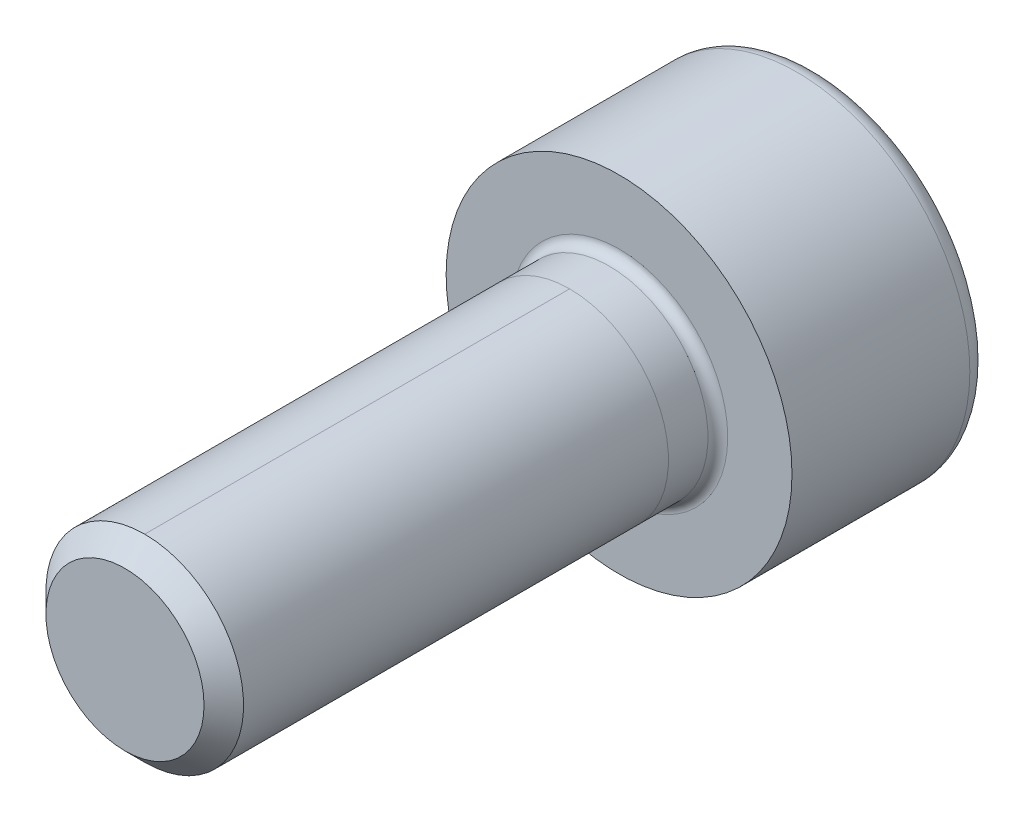
ISO-10303-21;
HEADER;
FILE_DESCRIPTION(('STEP AP214'),'2;1');
FILE_NAME('part.step','',(''),(''),'','','');
FILE_SCHEMA(('AUTOMOTIVE_DESIGN { 1 0 10303 214 1 1 1 1 }'));
ENDSEC;
DATA;
#1=APPLICATION_CONTEXT('core data for automotive mechanical design processes');
#2=APPLICATION_PROTOCOL_DEFINITION('international standard','automotive_design',2000,#1);
#3=PRODUCT_CONTEXT('',#1,'mechanical');
#4=PRODUCT('Part','Part','',(#3));
#5=PRODUCT_RELATED_PRODUCT_CATEGORY('part','',(#4));
#6=PRODUCT_DEFINITION_FORMATION('','',#4);
#7=PRODUCT_DEFINITION_CONTEXT('part definition',#1,'design');
#8=PRODUCT_DEFINITION('design','',#6,#7);
#9=PRODUCT_DEFINITION_SHAPE('','',#8);
#10=(LENGTH_UNIT() NAMED_UNIT(*) SI_UNIT(.MILLI.,.METRE.));
#11=(NAMED_UNIT(*) PLANE_ANGLE_UNIT() SI_UNIT($,.RADIAN.));
#12=(NAMED_UNIT(*) SI_UNIT($,.STERADIAN.) SOLID_ANGLE_UNIT());
#13=UNCERTAINTY_MEASURE_WITH_UNIT(LENGTH_MEASURE(1.E-05),#10,'distance_accuracy_value','');
#14=(GEOMETRIC_REPRESENTATION_CONTEXT(3) GLOBAL_UNCERTAINTY_ASSIGNED_CONTEXT((#13)) GLOBAL_UNIT_ASSIGNED_CONTEXT((#10,
#11,#12)) REPRESENTATION_CONTEXT('',''));
#15=CARTESIAN_POINT('',(0.,0.,0.));
#16=DIRECTION('',(0.,0.,1.));
#17=DIRECTION('',(1.,0.,0.));
#18=AXIS2_PLACEMENT_3D('',#15,#16,#17);
#19=CARTESIAN_POINT('',(0.,0.,10.));
#20=DIRECTION('',(0.,0.,-1.));
#21=DIRECTION('',(-1.,0.,0.));
#22=AXIS2_PLACEMENT_3D('',#19,#20,#21);
#23=CYLINDRICAL_SURFACE('',#22,2.);
#24=DIRECTION('',(0.,0.,-1.));
#25=VECTOR('',#24,1.);
#26=CARTESIAN_POINT('',(0.,2.,10.));
#27=LINE('',#26,#25);
#28=CARTESIAN_POINT('',(0.,2.,9.6));
#29=VERTEX_POINT('',#28);
#30=CARTESIAN_POINT('',(0.,2.,1.));
#31=VERTEX_POINT('',#30);
#32=EDGE_CURVE('E60',#29,#31,#27,.T.);
#33=ORIENTED_EDGE('',*,*,#32,.F.);
#34=CARTESIAN_POINT('',(0.,0.,9.6));
#35=DIRECTION('',(0.,0.,1.));
#36=DIRECTION('',(1.,0.,0.));
#37=AXIS2_PLACEMENT_3D('',#34,#35,#36);
#38=CIRCLE('',#37,2.);
#39=CARTESIAN_POINT('',(0.,-2.,9.6));
#40=VERTEX_POINT('',#39);
#41=EDGE_CURVE('E194',#29,#40,#38,.F.);
#42=ORIENTED_EDGE('',*,*,#41,.T.);
#43=DIRECTION('',(0.,0.,-1.));
#44=VECTOR('',#43,1.);
#45=CARTESIAN_POINT('',(0.,-2.,10.));
#46=LINE('',#45,#44);
#47=CARTESIAN_POINT('',(0.,-2.,0.999999999999999));
#48=VERTEX_POINT('',#47);
#49=EDGE_CURVE('E197',#40,#48,#46,.T.);
#50=ORIENTED_EDGE('',*,*,#49,.T.);
#51=CARTESIAN_POINT('',(0.,0.,0.999999999999999));
#52=DIRECTION('',(0.,0.,1.));
#53=DIRECTION('',(0.,-1.,0.));
#54=AXIS2_PLACEMENT_3D('',#51,#52,#53);
#55=CIRCLE('',#54,2.);
#56=EDGE_CURVE('E66',#48,#31,#55,.T.);
#57=ORIENTED_EDGE('',*,*,#56,.T.);
#58=EDGE_LOOP('',(#33,#42,#50,#57));
#59=FACE_BOUND('',#58,.T.);
#60=ADVANCED_FACE('F45',(#59),#23,.T.);
#61=CARTESIAN_POINT('',(0.,0.,0.200000000000001));
#62=DIRECTION('',(0.,0.,-1.));
#63=DIRECTION('',(-1.,0.,0.));
#64=AXIS2_PLACEMENT_3D('',#61,#62,#63);
#65=CIRCLE('',#64,2.);
#66=CARTESIAN_POINT('',(-2.,0.,0.200000000000001));
#67=VERTEX_POINT('',#66);
#68=EDGE_CURVE('E12',#67,#67,#65,.F.);
#69=ORIENTED_EDGE('',*,*,#68,.T.);
#70=EDGE_LOOP('',(#69));
#71=FACE_BOUND('',#70,.T.);
#72=ORIENTED_EDGE('',*,*,#56,.F.);
#73=EDGE_CURVE('E219',#31,#48,#55,.T.);
#74=ORIENTED_EDGE('',*,*,#73,.F.);
#75=EDGE_LOOP('',(#72,#74));
#76=FACE_BOUND('',#75,.T.);
#77=ADVANCED_FACE('F237',(#71,#76),#23,.T.);
#78=EDGE_CURVE('E195',#40,#29,#38,.F.);
#79=ORIENTED_EDGE('',*,*,#78,.T.);
#80=ORIENTED_EDGE('',*,*,#32,.T.);
#81=ORIENTED_EDGE('',*,*,#73,.T.);
#82=ORIENTED_EDGE('',*,*,#49,.F.);
#83=EDGE_LOOP('',(#79,#80,#81,#82));
#84=FACE_BOUND('',#83,.T.);
#85=ADVANCED_FACE('F240',(#84),#23,.T.);
#86=CARTESIAN_POINT('',(0.,0.,10.));
#87=DIRECTION('',(0.,0.,1.));
#88=DIRECTION('',(1.,0.,0.));
#89=AXIS2_PLACEMENT_3D('',#86,#87,#88);
#90=PLANE('',#89);
#91=CARTESIAN_POINT('',(0.,0.,10.));
#92=DIRECTION('',(0.,0.,1.));
#93=DIRECTION('',(1.,0.,0.));
#94=AXIS2_PLACEMENT_3D('',#91,#92,#93);
#95=CIRCLE('',#94,1.6);
#96=CARTESIAN_POINT('',(1.6,0.,10.));
#97=VERTEX_POINT('',#96);
#98=EDGE_CURVE('E191',#97,#97,#95,.T.);
#99=ORIENTED_EDGE('',*,*,#98,.T.);
#100=EDGE_LOOP('',(#99));
#101=FACE_BOUND('',#100,.T.);
#102=ADVANCED_FACE('F248',(#101),#90,.T.);
#103=CARTESIAN_POINT('',(0.,0.,0.));
#104=DIRECTION('',(0.,0.,-1.));
#105=DIRECTION('',(-1.,0.,0.));
#106=AXIS2_PLACEMENT_3D('',#103,#104,#105);
#107=PLANE('',#106);
#108=CARTESIAN_POINT('',(0.,0.,0.));
#109=DIRECTION('',(0.,0.,-1.));
#110=DIRECTION('',(-1.,0.,0.));
#111=AXIS2_PLACEMENT_3D('',#108,#109,#110);
#112=CIRCLE('',#111,2.2);
#113=CARTESIAN_POINT('',(-2.2,0.,0.));
#114=VERTEX_POINT('',#113);
#115=EDGE_CURVE('E53',#114,#114,#112,.T.);
#116=ORIENTED_EDGE('',*,*,#115,.T.);
#117=EDGE_LOOP('',(#116));
#118=FACE_BOUND('',#117,.T.);
#119=CARTESIAN_POINT('',(0.,0.,0.));
#120=DIRECTION('',(0.,0.,-1.));
#121=DIRECTION('',(-1.,0.,0.));
#122=AXIS2_PLACEMENT_3D('',#119,#120,#121);
#123=CIRCLE('',#122,3.5);
#124=CARTESIAN_POINT('',(-3.5,0.,0.));
#125=VERTEX_POINT('',#124);
#126=EDGE_CURVE('E181',#125,#125,#123,.T.);
#127=ORIENTED_EDGE('',*,*,#126,.F.);
#128=EDGE_LOOP('',(#127));
#129=FACE_BOUND('',#128,.T.);
#130=ADVANCED_FACE('F226',(#118,#129),#107,.F.);
#131=CARTESIAN_POINT('',(0.,0.,-4.));
#132=DIRECTION('',(0.,0.,1.));
#133=DIRECTION('',(1.,0.,0.));
#134=AXIS2_PLACEMENT_3D('',#131,#132,#133);
#135=CYLINDRICAL_SURFACE('',#134,3.5);
#136=CARTESIAN_POINT('',(0.,0.,-3.6));
#137=DIRECTION('',(0.,0.,-1.));
#138=DIRECTION('',(-1.,0.,0.));
#139=AXIS2_PLACEMENT_3D('',#136,#137,#138);
#140=CIRCLE('',#139,3.5);
#141=CARTESIAN_POINT('',(-3.5,0.,-3.6));
#142=VERTEX_POINT('',#141);
#143=EDGE_CURVE('E188',#142,#142,#140,.F.);
#144=ORIENTED_EDGE('',*,*,#143,.T.);
#145=EDGE_LOOP('',(#144));
#146=FACE_BOUND('',#145,.T.);
#147=ORIENTED_EDGE('',*,*,#126,.T.);
#148=EDGE_LOOP('',(#147));
#149=FACE_BOUND('',#148,.T.);
#150=ADVANCED_FACE('F284',(#146,#149),#135,.T.);
#151=CARTESIAN_POINT('',(0.,0.,-4.));
#152=DIRECTION('',(0.,0.,-1.));
#153=DIRECTION('',(-1.,0.,0.));
#154=AXIS2_PLACEMENT_3D('',#151,#152,#153);
#155=PLANE('',#154);
#156=DIRECTION('',(0.5,-0.866025403784439,0.));
#157=VECTOR('',#156,1.);
#158=CARTESIAN_POINT('',(0.721687836487032,1.25,-4.));
#159=LINE('',#158,#157);
#160=CARTESIAN_POINT('',(0.721687836487032,1.25,-4.));
#161=VERTEX_POINT('',#160);
#162=CARTESIAN_POINT('',(1.44337567297406,0.,-4.));
#163=VERTEX_POINT('',#162);
#164=EDGE_CURVE('E124',#161,#163,#159,.T.);
#165=ORIENTED_EDGE('',*,*,#164,.F.);
#166=DIRECTION('',(1.,0.,0.));
#167=VECTOR('',#166,1.);
#168=CARTESIAN_POINT('',(-0.721687836487033,1.25,-4.));
#169=LINE('',#168,#167);
#170=CARTESIAN_POINT('',(-0.721687836487033,1.25,-4.));
#171=VERTEX_POINT('',#170);
#172=EDGE_CURVE('E178',#171,#161,#169,.T.);
#173=ORIENTED_EDGE('',*,*,#172,.F.);
#174=DIRECTION('',(0.5,0.866025403784439,0.));
#175=VECTOR('',#174,1.);
#176=CARTESIAN_POINT('',(-1.44337567297406,0.,-4.));
#177=LINE('',#176,#175);
#178=CARTESIAN_POINT('',(-1.44337567297406,0.,-4.));
#179=VERTEX_POINT('',#178);
#180=EDGE_CURVE('E175',#179,#171,#177,.T.);
#181=ORIENTED_EDGE('',*,*,#180,.F.);
#182=DIRECTION('',(-0.5,0.866025403784439,0.));
#183=VECTOR('',#182,1.);
#184=CARTESIAN_POINT('',(-0.721687836487033,-1.25,-4.));
#185=LINE('',#184,#183);
#186=CARTESIAN_POINT('',(-0.721687836487033,-1.25,-4.));
#187=VERTEX_POINT('',#186);
#188=EDGE_CURVE('E172',#187,#179,#185,.T.);
#189=ORIENTED_EDGE('',*,*,#188,.F.);
#190=DIRECTION('',(-1.,0.,0.));
#191=VECTOR('',#190,1.);
#192=CARTESIAN_POINT('',(0.721687836487032,-1.25,-4.));
#193=LINE('',#192,#191);
#194=CARTESIAN_POINT('',(0.721687836487032,-1.25,-4.));
#195=VERTEX_POINT('',#194);
#196=EDGE_CURVE('E169',#195,#187,#193,.T.);
#197=ORIENTED_EDGE('',*,*,#196,.F.);
#198=DIRECTION('',(-0.5,-0.866025403784439,0.));
#199=VECTOR('',#198,1.);
#200=CARTESIAN_POINT('',(1.44337567297406,0.,-4.));
#201=LINE('',#200,#199);
#202=EDGE_CURVE('E166',#163,#195,#201,.T.);
#203=ORIENTED_EDGE('',*,*,#202,.F.);
#204=EDGE_LOOP('',(#165,#173,#181,#189,#197,#203));
#205=FACE_BOUND('',#204,.T.);
#206=CARTESIAN_POINT('',(0.,0.,-4.));
#207=DIRECTION('',(0.,0.,-1.));
#208=DIRECTION('',(-1.,0.,0.));
#209=AXIS2_PLACEMENT_3D('',#206,#207,#208);
#210=CIRCLE('',#209,3.1);
#211=CARTESIAN_POINT('',(-3.1,0.,-4.));
#212=VERTEX_POINT('',#211);
#213=EDGE_CURVE('E184',#212,#212,#210,.T.);
#214=ORIENTED_EDGE('',*,*,#213,.T.);
#215=EDGE_LOOP('',(#214));
#216=FACE_BOUND('',#215,.T.);
#217=ADVANCED_FACE('F279',(#205,#216),#155,.T.);
#218=CARTESIAN_POINT('',(0.,0.,-3.6));
#219=DIRECTION('',(0.,0.,-1.));
#220=DIRECTION('',(-1.,0.,0.));
#221=AXIS2_PLACEMENT_3D('',#218,#219,#220);
#222=TOROIDAL_SURFACE('',#221,3.1,0.4);
#223=ORIENTED_EDGE('',*,*,#143,.F.);
#224=EDGE_LOOP('',(#223));
#225=FACE_BOUND('',#224,.T.);
#226=ORIENTED_EDGE('',*,*,#213,.F.);
#227=EDGE_LOOP('',(#226));
#228=FACE_BOUND('',#227,.T.);
#229=ADVANCED_FACE('F270',(#225,#228),#222,.T.);
#230=CARTESIAN_POINT('',(0.,0.,10.));
#231=DIRECTION('',(0.,0.,-1.));
#232=DIRECTION('',(-1.,0.,0.));
#233=AXIS2_PLACEMENT_3D('',#230,#231,#232);
#234=CONICAL_SURFACE('',#233,1.6,0.785398163397446);
#235=ORIENTED_EDGE('',*,*,#78,.F.);
#236=ORIENTED_EDGE('',*,*,#41,.F.);
#237=EDGE_LOOP('',(#235,#236));
#238=FACE_BOUND('',#237,.T.);
#239=ORIENTED_EDGE('',*,*,#98,.F.);
#240=EDGE_LOOP('',(#239));
#241=FACE_BOUND('',#240,.T.);
#242=ADVANCED_FACE('F257',(#238,#241),#234,.T.);
#243=CARTESIAN_POINT('',(0.721687836487032,1.25,-2.88888888888889));
#244=DIRECTION('',(0.866025403784439,0.5,0.));
#245=DIRECTION('',(-0.5,0.866025403784439,0.));
#246=AXIS2_PLACEMENT_3D('',#243,#244,#245);
#247=PLANE('',#246);
#248=ORIENTED_EDGE('',*,*,#164,.T.);
#249=DIRECTION('',(0.,0.,-1.));
#250=VECTOR('',#249,1.);
#251=CARTESIAN_POINT('',(1.44337567297406,0.,-2.88888888888889));
#252=LINE('',#251,#250);
#253=CARTESIAN_POINT('',(1.44337567297406,0.,-2.88888888888889));
#254=VERTEX_POINT('',#253);
#255=EDGE_CURVE('E202',#254,#163,#252,.T.);
#256=ORIENTED_EDGE('',*,*,#255,.F.);
#257=DIRECTION('',(-0.5,0.866025403784439,0.));
#258=VECTOR('',#257,1.);
#259=CARTESIAN_POINT('',(1.44337567297407,0.,-2.88888888888889));
#260=LINE('',#259,#258);
#261=CARTESIAN_POINT('',(0.721687836487032,1.25,-2.88888888888889));
#262=VERTEX_POINT('',#261);
#263=EDGE_CURVE('E119',#262,#254,#260,.F.);
#264=ORIENTED_EDGE('',*,*,#263,.F.);
#265=DIRECTION('',(0.,0.,-1.));
#266=VECTOR('',#265,1.);
#267=CARTESIAN_POINT('',(0.721687836487032,1.25,-2.88888888888889));
#268=LINE('',#267,#266);
#269=EDGE_CURVE('E185',#262,#161,#268,.T.);
#270=ORIENTED_EDGE('',*,*,#269,.T.);
#271=EDGE_LOOP('',(#248,#256,#264,#270));
#272=FACE_BOUND('',#271,.T.);
#273=ADVANCED_FACE('F269',(#272),#247,.F.);
#274=CARTESIAN_POINT('',(-0.721687836487033,1.25,-2.88888888888889));
#275=DIRECTION('',(0.,1.,0.));
#276=DIRECTION('',(-1.,0.,0.));
#277=AXIS2_PLACEMENT_3D('',#274,#275,#276);
#278=PLANE('',#277);
#279=ORIENTED_EDGE('',*,*,#172,.T.);
#280=ORIENTED_EDGE('',*,*,#269,.F.);
#281=DIRECTION('',(1.,0.,0.));
#282=VECTOR('',#281,1.);
#283=CARTESIAN_POINT('',(0.,1.25,-2.88888888888889));
#284=LINE('',#283,#282);
#285=CARTESIAN_POINT('',(-0.721687836487033,1.25,-2.88888888888889));
#286=VERTEX_POINT('',#285);
#287=EDGE_CURVE('E133',#286,#262,#284,.T.);
#288=ORIENTED_EDGE('',*,*,#287,.F.);
#289=DIRECTION('',(0.,0.,-1.));
#290=VECTOR('',#289,1.);
#291=CARTESIAN_POINT('',(-0.721687836487033,1.25,-2.88888888888889));
#292=LINE('',#291,#290);
#293=EDGE_CURVE('E198',#286,#171,#292,.T.);
#294=ORIENTED_EDGE('',*,*,#293,.T.);
#295=EDGE_LOOP('',(#279,#280,#288,#294));
#296=FACE_BOUND('',#295,.T.);
#297=ADVANCED_FACE('F276',(#296),#278,.F.);
#298=CARTESIAN_POINT('',(-1.44337567297406,0.,-2.88888888888889));
#299=DIRECTION('',(-0.866025403784439,0.5,0.));
#300=DIRECTION('',(-0.5,-0.866025403784439,0.));
#301=AXIS2_PLACEMENT_3D('',#298,#299,#300);
#302=PLANE('',#301);
#303=ORIENTED_EDGE('',*,*,#180,.T.);
#304=ORIENTED_EDGE('',*,*,#293,.F.);
#305=DIRECTION('',(-0.5,-0.866025403784439,0.));
#306=VECTOR('',#305,1.);
#307=CARTESIAN_POINT('',(-0.721687836487032,1.25,-2.88888888888889));
#308=LINE('',#307,#306);
#309=CARTESIAN_POINT('',(-1.44337567297406,0.,-2.88888888888889));
#310=VERTEX_POINT('',#309);
#311=EDGE_CURVE('E141',#310,#286,#308,.F.);
#312=ORIENTED_EDGE('',*,*,#311,.F.);
#313=DIRECTION('',(0.,0.,-1.));
#314=VECTOR('',#313,1.);
#315=CARTESIAN_POINT('',(-1.44337567297406,0.,-2.88888888888889));
#316=LINE('',#315,#314);
#317=EDGE_CURVE('E200',#310,#179,#316,.T.);
#318=ORIENTED_EDGE('',*,*,#317,.T.);
#319=EDGE_LOOP('',(#303,#304,#312,#318));
#320=FACE_BOUND('',#319,.T.);
#321=ADVANCED_FACE('F312',(#320),#302,.F.);
#322=CARTESIAN_POINT('',(-0.721687836487033,-1.25,-2.88888888888889));
#323=DIRECTION('',(-0.866025403784439,-0.5,0.));
#324=DIRECTION('',(0.5,-0.866025403784439,0.));
#325=AXIS2_PLACEMENT_3D('',#322,#323,#324);
#326=PLANE('',#325);
#327=ORIENTED_EDGE('',*,*,#188,.T.);
#328=ORIENTED_EDGE('',*,*,#317,.F.);
#329=DIRECTION('',(0.499999999999999,-0.866025403784439,0.));
#330=VECTOR('',#329,1.);
#331=CARTESIAN_POINT('',(-1.44337567297406,0.,-2.88888888888889));
#332=LINE('',#331,#330);
#333=CARTESIAN_POINT('',(-0.721687836487032,-1.25,-2.88888888888889));
#334=VERTEX_POINT('',#333);
#335=EDGE_CURVE('E149',#334,#310,#332,.F.);
#336=ORIENTED_EDGE('',*,*,#335,.F.);
#337=DIRECTION('',(0.,0.,-1.));
#338=VECTOR('',#337,1.);
#339=CARTESIAN_POINT('',(-0.721687836487033,-1.25,-2.88888888888889));
#340=LINE('',#339,#338);
#341=EDGE_CURVE('E207',#334,#187,#340,.T.);
#342=ORIENTED_EDGE('',*,*,#341,.T.);
#343=EDGE_LOOP('',(#327,#328,#336,#342));
#344=FACE_BOUND('',#343,.T.);
#345=ADVANCED_FACE('F308',(#344),#326,.F.);
#346=CARTESIAN_POINT('',(0.721687836487032,-1.25,-2.88888888888889));
#347=DIRECTION('',(0.,-1.,0.));
#348=DIRECTION('',(1.,0.,0.));
#349=AXIS2_PLACEMENT_3D('',#346,#347,#348);
#350=PLANE('',#349);
#351=ORIENTED_EDGE('',*,*,#196,.T.);
#352=ORIENTED_EDGE('',*,*,#341,.F.);
#353=DIRECTION('',(1.,0.,0.));
#354=VECTOR('',#353,1.);
#355=CARTESIAN_POINT('',(0.,-1.25,-2.88888888888889));
#356=LINE('',#355,#354);
#357=CARTESIAN_POINT('',(0.721687836487033,-1.25,-2.88888888888889));
#358=VERTEX_POINT('',#357);
#359=EDGE_CURVE('E156',#358,#334,#356,.F.);
#360=ORIENTED_EDGE('',*,*,#359,.F.);
#361=DIRECTION('',(0.,0.,-1.));
#362=VECTOR('',#361,1.);
#363=CARTESIAN_POINT('',(0.721687836487032,-1.25,-2.88888888888889));
#364=LINE('',#363,#362);
#365=EDGE_CURVE('E205',#358,#195,#364,.T.);
#366=ORIENTED_EDGE('',*,*,#365,.T.);
#367=EDGE_LOOP('',(#351,#352,#360,#366));
#368=FACE_BOUND('',#367,.T.);
#369=ADVANCED_FACE('F304',(#368),#350,.F.);
#370=CARTESIAN_POINT('',(1.44337567297406,0.,-2.88888888888889));
#371=DIRECTION('',(0.866025403784439,-0.5,0.));
#372=DIRECTION('',(0.5,0.866025403784439,0.));
#373=AXIS2_PLACEMENT_3D('',#370,#371,#372);
#374=PLANE('',#373);
#375=ORIENTED_EDGE('',*,*,#202,.T.);
#376=ORIENTED_EDGE('',*,*,#365,.F.);
#377=DIRECTION('',(0.5,0.866025403784439,0.));
#378=VECTOR('',#377,1.);
#379=CARTESIAN_POINT('',(0.721687836487032,-1.25,-2.88888888888889));
#380=LINE('',#379,#378);
#381=EDGE_CURVE('E161',#254,#358,#380,.F.);
#382=ORIENTED_EDGE('',*,*,#381,.F.);
#383=ORIENTED_EDGE('',*,*,#255,.T.);
#384=EDGE_LOOP('',(#375,#376,#382,#383));
#385=FACE_BOUND('',#384,.T.);
#386=ADVANCED_FACE('F301',(#385),#374,.F.);
#387=CARTESIAN_POINT('',(-0.668217760044109,-0.385795703638755,-2.170100832968));
#388=DIRECTION('',(0.290126882702444,0.167504833827403,0.942214690279141));
#389=DIRECTION('',(0.955717783517745,0.,-0.294284757111084));
#390=AXIS2_PLACEMENT_3D('',#387,#388,#389);
#391=PLANE('',#390);
#392=DIRECTION('',(-0.477858891758872,-0.827675879374923,0.294284757111084));
#393=VECTOR('',#392,1.);
#394=CARTESIAN_POINT('',(0.721687836487032,1.25,-2.88888888888889));
#395=LINE('',#394,#393);
#396=CARTESIAN_POINT('',(0.,0.,-2.44444444444444));
#397=VERTEX_POINT('',#396);
#398=EDGE_CURVE('E116',#262,#397,#395,.T.);
#399=ORIENTED_EDGE('',*,*,#398,.F.);
#400=ORIENTED_EDGE('',*,*,#263,.T.);
#401=DIRECTION('',(-0.955717783517745,0.,0.294284757111084));
#402=VECTOR('',#401,1.);
#403=CARTESIAN_POINT('',(1.44337567297406,0.,-2.88888888888889));
#404=LINE('',#403,#402);
#405=EDGE_CURVE('E113',#254,#397,#404,.T.);
#406=ORIENTED_EDGE('',*,*,#405,.T.);
#407=EDGE_LOOP('',(#399,#400,#406));
#408=FACE_BOUND('',#407,.T.);
#409=ADVANCED_FACE('F115',(#408),#391,.F.);
#410=CARTESIAN_POINT('',(-0.668217760044109,0.385795703638755,-2.170100832968));
#411=DIRECTION('',(0.290126882702444,-0.167504833827403,0.942214690279141));
#412=DIRECTION('',(0.955717783517745,0.,-0.294284757111084));
#413=AXIS2_PLACEMENT_3D('',#410,#411,#412);
#414=PLANE('',#413);
#415=ORIENTED_EDGE('',*,*,#405,.F.);
#416=ORIENTED_EDGE('',*,*,#381,.T.);
#417=DIRECTION('',(-0.477858891758872,0.827675879374923,0.294284757111084));
#418=VECTOR('',#417,1.);
#419=CARTESIAN_POINT('',(0.721687836487032,-1.25,-2.88888888888889));
#420=LINE('',#419,#418);
#421=EDGE_CURVE('E154',#358,#397,#420,.T.);
#422=ORIENTED_EDGE('',*,*,#421,.T.);
#423=EDGE_LOOP('',(#415,#416,#422));
#424=FACE_BOUND('',#423,.T.);
#425=ADVANCED_FACE('F159',(#424),#414,.F.);
#426=CARTESIAN_POINT('',(0.,-0.77159140727751,-2.170100832968));
#427=DIRECTION('',(0.,0.335009667654805,0.942214690279141));
#428=DIRECTION('',(0.,-0.942214690279141,0.335009667654805));
#429=AXIS2_PLACEMENT_3D('',#426,#427,#428);
#430=PLANE('',#429);
#431=DIRECTION('',(0.477858891758872,-0.827675879374923,0.294284757111084));
#432=VECTOR('',#431,1.);
#433=CARTESIAN_POINT('',(-0.721687836487033,1.25,-2.88888888888889));
#434=LINE('',#433,#432);
#435=EDGE_CURVE('E130',#286,#397,#434,.T.);
#436=ORIENTED_EDGE('',*,*,#435,.F.);
#437=ORIENTED_EDGE('',*,*,#287,.T.);
#438=ORIENTED_EDGE('',*,*,#398,.T.);
#439=EDGE_LOOP('',(#436,#437,#438));
#440=FACE_BOUND('',#439,.T.);
#441=ADVANCED_FACE('F129',(#440),#430,.F.);
#442=CARTESIAN_POINT('',(0.668217760044109,-0.385795703638755,-2.170100832968));
#443=DIRECTION('',(-0.290126882702443,0.167504833827403,0.942214690279141));
#444=DIRECTION('',(0.955717783517745,0.,0.294284757111084));
#445=AXIS2_PLACEMENT_3D('',#442,#443,#444);
#446=PLANE('',#445);
#447=DIRECTION('',(0.955717783517745,0.,0.294284757111084));
#448=VECTOR('',#447,1.);
#449=CARTESIAN_POINT('',(-1.44337567297406,0.,-2.88888888888889));
#450=LINE('',#449,#448);
#451=EDGE_CURVE('E138',#310,#397,#450,.T.);
#452=ORIENTED_EDGE('',*,*,#451,.F.);
#453=ORIENTED_EDGE('',*,*,#311,.T.);
#454=ORIENTED_EDGE('',*,*,#435,.T.);
#455=EDGE_LOOP('',(#452,#453,#454));
#456=FACE_BOUND('',#455,.T.);
#457=ADVANCED_FACE('F137',(#456),#446,.F.);
#458=CARTESIAN_POINT('',(0.668217760044109,0.385795703638755,-2.170100832968));
#459=DIRECTION('',(-0.290126882702444,-0.167504833827403,0.942214690279141));
#460=DIRECTION('',(0.955717783517744,0.,0.294284757111084));
#461=AXIS2_PLACEMENT_3D('',#458,#459,#460);
#462=PLANE('',#461);
#463=DIRECTION('',(0.477858891758872,0.827675879374923,0.294284757111084));
#464=VECTOR('',#463,1.);
#465=CARTESIAN_POINT('',(-0.721687836487033,-1.25,-2.88888888888889));
#466=LINE('',#465,#464);
#467=EDGE_CURVE('E146',#334,#397,#466,.T.);
#468=ORIENTED_EDGE('',*,*,#467,.F.);
#469=ORIENTED_EDGE('',*,*,#335,.T.);
#470=ORIENTED_EDGE('',*,*,#451,.T.);
#471=EDGE_LOOP('',(#468,#469,#470));
#472=FACE_BOUND('',#471,.T.);
#473=ADVANCED_FACE('F145',(#472),#462,.F.);
#474=CARTESIAN_POINT('',(0.,0.77159140727751,-2.170100832968));
#475=DIRECTION('',(0.,-0.335009667654805,0.942214690279141));
#476=DIRECTION('',(0.,-0.942214690279141,-0.335009667654806));
#477=AXIS2_PLACEMENT_3D('',#474,#475,#476);
#478=PLANE('',#477);
#479=ORIENTED_EDGE('',*,*,#421,.F.);
#480=ORIENTED_EDGE('',*,*,#359,.T.);
#481=ORIENTED_EDGE('',*,*,#467,.T.);
#482=EDGE_LOOP('',(#479,#480,#481));
#483=FACE_BOUND('',#482,.T.);
#484=ADVANCED_FACE('F153',(#483),#478,.F.);
#485=CARTESIAN_POINT('',(0.,0.,0.200000000000001));
#486=DIRECTION('',(0.,0.,-1.));
#487=DIRECTION('',(-1.,0.,0.));
#488=AXIS2_PLACEMENT_3D('',#485,#486,#487);
#489=TOROIDAL_SURFACE('',#488,2.2,0.2);
#490=ORIENTED_EDGE('',*,*,#68,.F.);
#491=EDGE_LOOP('',(#490));
#492=FACE_BOUND('',#491,.T.);
#493=ORIENTED_EDGE('',*,*,#115,.F.);
#494=EDGE_LOOP('',(#493));
#495=FACE_BOUND('',#494,.T.);
#496=ADVANCED_FACE('F47',(#492,#495),#489,.F.);
#497=CLOSED_SHELL('',(#60,#77,#85,#102,#130,#150,#217,#229,#242,#273,#297,#321,#345,#369,#386,
#409,#425,#441,#457,#473,#484,#496));
#498=MANIFOLD_SOLID_BREP('B2',#497);
#499=ADVANCED_BREP_SHAPE_REPRESENTATION('',(#18,#498),#14);
#500=SHAPE_DEFINITION_REPRESENTATION(#9,#499);
ENDSEC;
END-ISO-10303-21;
